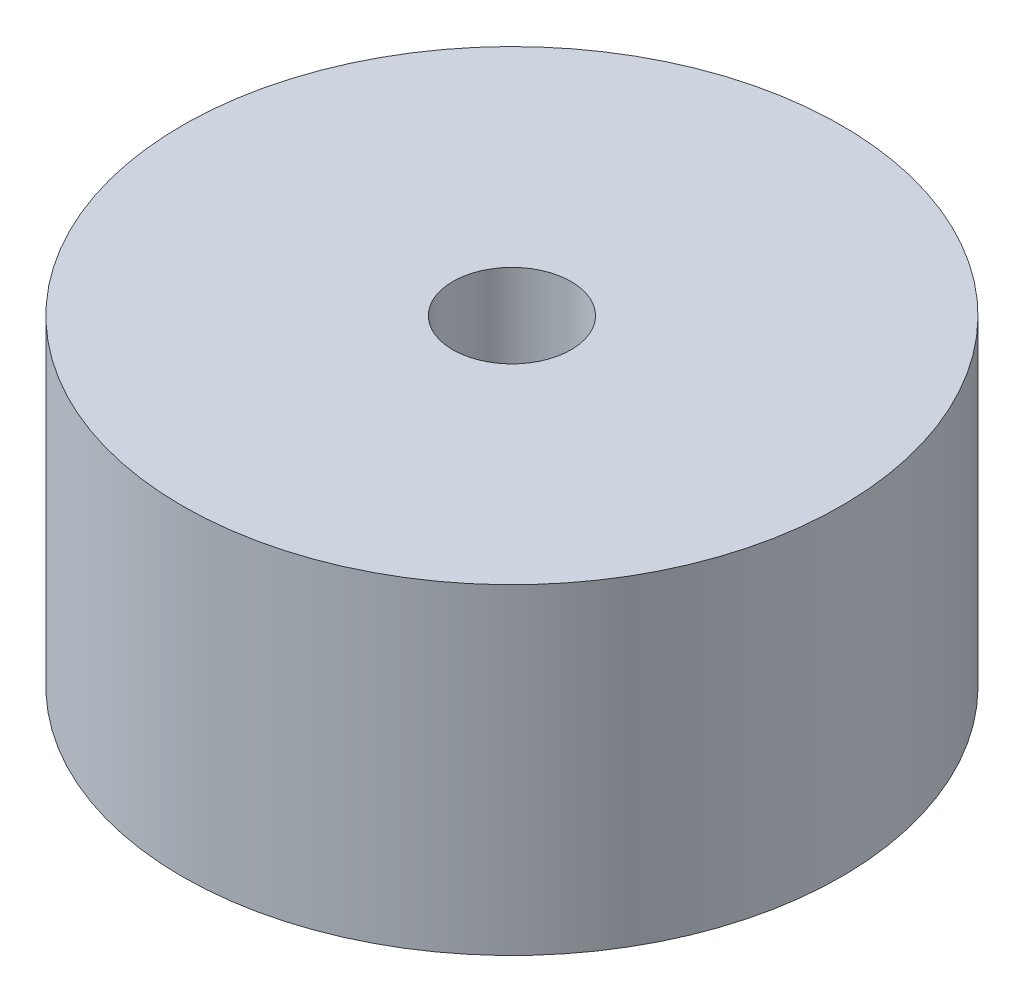
ISO-10303-21;
HEADER;
FILE_DESCRIPTION(('STEP AP214'),'2;1');
FILE_NAME('part.step','',(''),(''),'','','');
FILE_SCHEMA(('AUTOMOTIVE_DESIGN { 1 0 10303 214 1 1 1 1 }'));
ENDSEC;
DATA;
#1=APPLICATION_CONTEXT('core data for automotive mechanical design processes');
#2=APPLICATION_PROTOCOL_DEFINITION('international standard','automotive_design',2000,#1);
#3=PRODUCT_CONTEXT('',#1,'mechanical');
#4=PRODUCT('Part','Part','',(#3));
#5=PRODUCT_RELATED_PRODUCT_CATEGORY('part','',(#4));
#6=PRODUCT_DEFINITION_FORMATION('','',#4);
#7=PRODUCT_DEFINITION_CONTEXT('part definition',#1,'design');
#8=PRODUCT_DEFINITION('design','',#6,#7);
#9=PRODUCT_DEFINITION_SHAPE('','',#8);
#10=(LENGTH_UNIT() NAMED_UNIT(*) SI_UNIT(.MILLI.,.METRE.));
#11=(NAMED_UNIT(*) PLANE_ANGLE_UNIT() SI_UNIT($,.RADIAN.));
#12=(NAMED_UNIT(*) SI_UNIT($,.STERADIAN.) SOLID_ANGLE_UNIT());
#13=UNCERTAINTY_MEASURE_WITH_UNIT(LENGTH_MEASURE(1.E-05),#10,'distance_accuracy_value','');
#14=(GEOMETRIC_REPRESENTATION_CONTEXT(3) GLOBAL_UNCERTAINTY_ASSIGNED_CONTEXT((#13)) GLOBAL_UNIT_ASSIGNED_CONTEXT((#10,
#11,#12)) REPRESENTATION_CONTEXT('',''));
#15=CARTESIAN_POINT('',(0.,0.,0.));
#16=DIRECTION('',(0.,0.,1.));
#17=DIRECTION('',(1.,0.,0.));
#18=AXIS2_PLACEMENT_3D('',#15,#16,#17);
#19=CARTESIAN_POINT('',(0.,19.,0.));
#20=DIRECTION('',(0.,1.,0.));
#21=DIRECTION('',(0.,0.,1.));
#22=AXIS2_PLACEMENT_3D('',#19,#20,#21);
#23=PLANE('',#22);
#24=CARTESIAN_POINT('',(0.,19.,0.));
#25=DIRECTION('',(0.,1.,0.));
#26=DIRECTION('',(0.,0.,1.));
#27=AXIS2_PLACEMENT_3D('',#24,#25,#26);
#28=CIRCLE('',#27,19.5);
#29=CARTESIAN_POINT('',(0.,19.,19.5));
#30=VERTEX_POINT('',#29);
#31=EDGE_CURVE('E10',#30,#30,#28,.T.);
#32=ORIENTED_EDGE('',*,*,#31,.T.);
#33=EDGE_LOOP('',(#32));
#34=FACE_BOUND('',#33,.T.);
#35=CARTESIAN_POINT('',(0.,19.,0.));
#36=DIRECTION('',(0.,1.,0.));
#37=DIRECTION('',(0.,0.,1.));
#38=AXIS2_PLACEMENT_3D('',#35,#36,#37);
#39=CIRCLE('',#38,3.5);
#40=CARTESIAN_POINT('',(0.,19.,3.5));
#41=VERTEX_POINT('',#40);
#42=EDGE_CURVE('E41',#41,#41,#39,.T.);
#43=ORIENTED_EDGE('',*,*,#42,.F.);
#44=EDGE_LOOP('',(#43));
#45=FACE_BOUND('',#44,.T.);
#46=ADVANCED_FACE('F30',(#34,#45),#23,.T.);
#47=CARTESIAN_POINT('',(0.,0.,0.));
#48=DIRECTION('',(0.,1.,0.));
#49=DIRECTION('',(0.,0.,1.));
#50=AXIS2_PLACEMENT_3D('',#47,#48,#49);
#51=PLANE('',#50);
#52=CARTESIAN_POINT('',(0.,0.,0.));
#53=DIRECTION('',(0.,1.,0.));
#54=DIRECTION('',(0.,0.,1.));
#55=AXIS2_PLACEMENT_3D('',#52,#53,#54);
#56=CIRCLE('',#55,19.5);
#57=CARTESIAN_POINT('',(0.,0.,19.5));
#58=VERTEX_POINT('',#57);
#59=EDGE_CURVE('E34',#58,#58,#56,.T.);
#60=ORIENTED_EDGE('',*,*,#59,.F.);
#61=EDGE_LOOP('',(#60));
#62=FACE_BOUND('',#61,.T.);
#63=CARTESIAN_POINT('',(0.,0.,0.));
#64=DIRECTION('',(0.,1.,0.));
#65=DIRECTION('',(0.,0.,1.));
#66=AXIS2_PLACEMENT_3D('',#63,#64,#65);
#67=CIRCLE('',#66,3.5);
#68=CARTESIAN_POINT('',(0.,0.,3.5));
#69=VERTEX_POINT('',#68);
#70=EDGE_CURVE('E43',#69,#69,#67,.T.);
#71=ORIENTED_EDGE('',*,*,#70,.T.);
#72=EDGE_LOOP('',(#71));
#73=FACE_BOUND('',#72,.T.);
#74=ADVANCED_FACE('F53',(#62,#73),#51,.F.);
#75=CARTESIAN_POINT('',(0.,19.,0.));
#76=DIRECTION('',(0.,-1.,0.));
#77=DIRECTION('',(0.,0.,-1.));
#78=AXIS2_PLACEMENT_3D('',#75,#76,#77);
#79=CYLINDRICAL_SURFACE('',#78,19.5);
#80=ORIENTED_EDGE('',*,*,#31,.F.);
#81=EDGE_LOOP('',(#80));
#82=FACE_BOUND('',#81,.T.);
#83=ORIENTED_EDGE('',*,*,#59,.T.);
#84=EDGE_LOOP('',(#83));
#85=FACE_BOUND('',#84,.T.);
#86=ADVANCED_FACE('F32',(#82,#85),#79,.T.);
#87=CARTESIAN_POINT('',(0.,19.,0.));
#88=DIRECTION('',(0.,-1.,0.));
#89=DIRECTION('',(0.,0.,-1.));
#90=AXIS2_PLACEMENT_3D('',#87,#88,#89);
#91=CYLINDRICAL_SURFACE('',#90,3.5);
#92=ORIENTED_EDGE('',*,*,#42,.T.);
#93=EDGE_LOOP('',(#92));
#94=FACE_BOUND('',#93,.T.);
#95=ORIENTED_EDGE('',*,*,#70,.F.);
#96=EDGE_LOOP('',(#95));
#97=FACE_BOUND('',#96,.T.);
#98=ADVANCED_FACE('F49',(#94,#97),#91,.F.);
#99=CLOSED_SHELL('',(#46,#74,#86,#98));
#100=MANIFOLD_SOLID_BREP('B2',#99);
#101=ADVANCED_BREP_SHAPE_REPRESENTATION('',(#18,#100),#14);
#102=SHAPE_DEFINITION_REPRESENTATION(#9,#101);
ENDSEC;
END-ISO-10303-21;
